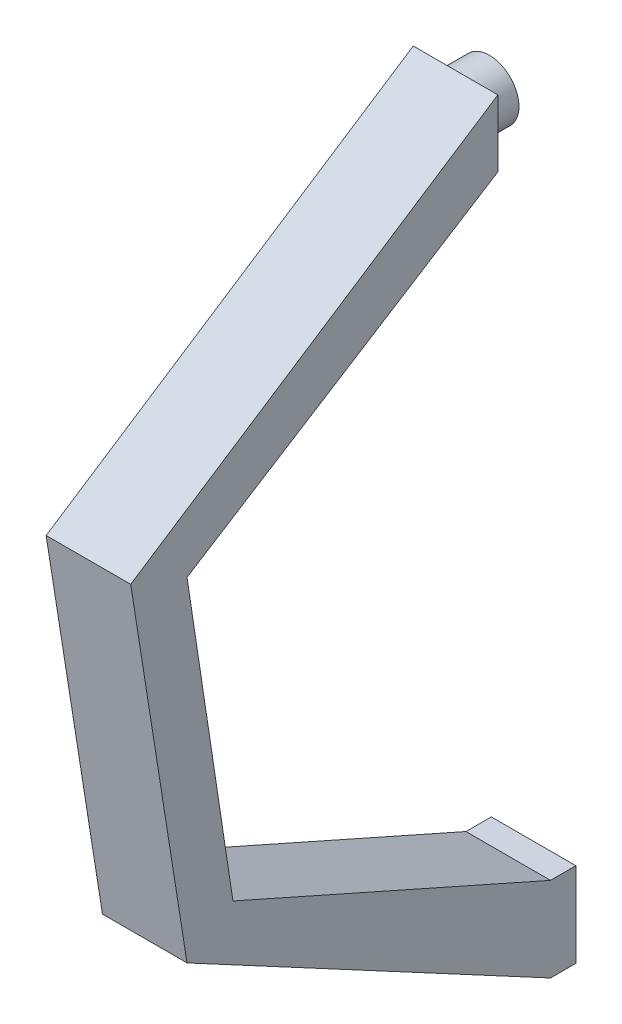
ISO-10303-21;
HEADER;
FILE_DESCRIPTION(('STEP AP214'),'2;1');
FILE_NAME('part.step','',(''),(''),'','','');
FILE_SCHEMA(('AUTOMOTIVE_DESIGN { 1 0 10303 214 1 1 1 1 }'));
ENDSEC;
DATA;
#1=APPLICATION_CONTEXT('core data for automotive mechanical design processes');
#2=APPLICATION_PROTOCOL_DEFINITION('international standard','automotive_design',2000,#1);
#3=PRODUCT_CONTEXT('',#1,'mechanical');
#4=PRODUCT('Part','Part','',(#3));
#5=PRODUCT_RELATED_PRODUCT_CATEGORY('part','',(#4));
#6=PRODUCT_DEFINITION_FORMATION('','',#4);
#7=PRODUCT_DEFINITION_CONTEXT('part definition',#1,'design');
#8=PRODUCT_DEFINITION('design','',#6,#7);
#9=PRODUCT_DEFINITION_SHAPE('','',#8);
#10=(LENGTH_UNIT() NAMED_UNIT(*) SI_UNIT(.MILLI.,.METRE.));
#11=(NAMED_UNIT(*) PLANE_ANGLE_UNIT() SI_UNIT($,.RADIAN.));
#12=(NAMED_UNIT(*) SI_UNIT($,.STERADIAN.) SOLID_ANGLE_UNIT());
#13=UNCERTAINTY_MEASURE_WITH_UNIT(LENGTH_MEASURE(1.E-05),#10,'distance_accuracy_value','');
#14=(GEOMETRIC_REPRESENTATION_CONTEXT(3) GLOBAL_UNCERTAINTY_ASSIGNED_CONTEXT((#13)) GLOBAL_UNIT_ASSIGNED_CONTEXT((#10,
#11,#12)) REPRESENTATION_CONTEXT('',''));
#15=CARTESIAN_POINT('',(0.,0.,0.));
#16=DIRECTION('',(0.,0.,1.));
#17=DIRECTION('',(1.,0.,0.));
#18=AXIS2_PLACEMENT_3D('',#15,#16,#17);
#19=CARTESIAN_POINT('',(0.,100.,30.));
#20=DIRECTION('',(1.,0.,0.));
#21=DIRECTION('',(0.,1.,0.));
#22=AXIS2_PLACEMENT_3D('',#19,#20,#21);
#23=PLANE('',#22);
#24=DIRECTION('',(0.,-1.,0.));
#25=VECTOR('',#24,1.);
#26=CARTESIAN_POINT('',(0.,100.,0.));
#27=LINE('',#26,#25);
#28=CARTESIAN_POINT('',(0.,100.,0.));
#29=VERTEX_POINT('',#28);
#30=CARTESIAN_POINT('',(0.,0.,0.));
#31=VERTEX_POINT('',#30);
#32=EDGE_CURVE('E154',#29,#31,#27,.T.);
#33=ORIENTED_EDGE('',*,*,#32,.T.);
#34=DIRECTION('',(0.,0.,-1.));
#35=VECTOR('',#34,1.);
#36=CARTESIAN_POINT('',(0.,0.,30.));
#37=LINE('',#36,#35);
#38=CARTESIAN_POINT('',(0.,0.,30.));
#39=VERTEX_POINT('',#38);
#40=EDGE_CURVE('E54',#39,#31,#37,.T.);
#41=ORIENTED_EDGE('',*,*,#40,.F.);
#42=DIRECTION('',(0.,0.472352728137515,0.881409609784831));
#43=VECTOR('',#42,1.);
#44=CARTESIAN_POINT('',(0.,0.,30.));
#45=LINE('',#44,#43);
#46=CARTESIAN_POINT('',(0.,230.355875202712,459.843779826663));
#47=VERTEX_POINT('',#46);
#48=EDGE_CURVE('E148',#39,#47,#45,.T.);
#49=ORIENTED_EDGE('',*,*,#48,.T.);
#50=DIRECTION('',(0.,-0.98772396333575,-0.156209385929012));
#51=VECTOR('',#50,1.);
#52=CARTESIAN_POINT('',(0.,651.42213648852,526.435767621256));
#53=LINE('',#52,#51);
#54=CARTESIAN_POINT('',(0.,651.42213648852,526.435767621256));
#55=VERTEX_POINT('',#54);
#56=EDGE_CURVE('E358',#55,#47,#53,.T.);
#57=ORIENTED_EDGE('',*,*,#56,.F.);
#58=DIRECTION('',(0.,-0.54770302127678,0.836672815671865));
#59=VECTOR('',#58,1.);
#60=CARTESIAN_POINT('',(0.,935.622570944281,92.2903120110954));
#61=LINE('',#60,#59);
#62=CARTESIAN_POINT('',(0.,935.622570944281,92.2903120110954));
#63=VERTEX_POINT('',#62);
#64=EDGE_CURVE('E355',#63,#55,#61,.T.);
#65=ORIENTED_EDGE('',*,*,#64,.F.);
#66=DIRECTION('',(0.,1.,0.));
#67=VECTOR('',#66,1.);
#68=CARTESIAN_POINT('',(0.,856.669682909021,92.2903120110954));
#69=LINE('',#68,#67);
#70=CARTESIAN_POINT('',(0.,856.669682909021,92.2903120110954));
#71=VERTEX_POINT('',#70);
#72=EDGE_CURVE('E352',#71,#63,#69,.T.);
#73=ORIENTED_EDGE('',*,*,#72,.F.);
#74=DIRECTION('',(0.,0.532798568616356,-0.846242096140556));
#75=VECTOR('',#74,1.);
#76=CARTESIAN_POINT('',(0.,625.256045564294,459.843779826663));
#77=LINE('',#76,#75);
#78=CARTESIAN_POINT('',(0.,625.256045564294,459.843779826663));
#79=VERTEX_POINT('',#78);
#80=EDGE_CURVE('E349',#79,#71,#77,.T.);
#81=ORIENTED_EDGE('',*,*,#80,.F.);
#82=DIRECTION('',(0.,0.988730161321214,0.149708610619849));
#83=VECTOR('',#82,1.);
#84=CARTESIAN_POINT('',(0.,266.651744151066,405.545697471072));
#85=LINE('',#84,#83);
#86=CARTESIAN_POINT('',(0.,266.651744151066,405.545697471072));
#87=VERTEX_POINT('',#86);
#88=EDGE_CURVE('E328',#87,#79,#85,.T.);
#89=ORIENTED_EDGE('',*,*,#88,.F.);
#90=DIRECTION('',(0.,0.405615138377561,0.914043959292414));
#91=VECTOR('',#90,1.);
#92=CARTESIAN_POINT('',(0.,100.,30.));
#93=LINE('',#92,#91);
#94=CARTESIAN_POINT('',(0.,100.,30.));
#95=VERTEX_POINT('',#94);
#96=EDGE_CURVE('E152',#95,#87,#93,.T.);
#97=ORIENTED_EDGE('',*,*,#96,.F.);
#98=DIRECTION('',(0.,0.,-1.));
#99=VECTOR('',#98,1.);
#100=CARTESIAN_POINT('',(0.,100.,30.));
#101=LINE('',#100,#99);
#102=EDGE_CURVE('E169',#95,#29,#101,.T.);
#103=ORIENTED_EDGE('',*,*,#102,.T.);
#104=EDGE_LOOP('',(#33,#41,#49,#57,#65,#73,#81,#89,#97,#103));
#105=FACE_BOUND('',#104,.T.);
#106=ADVANCED_FACE('F45',(#105),#23,.F.);
#107=CARTESIAN_POINT('',(0.,0.,30.));
#108=DIRECTION('',(0.,1.,0.));
#109=DIRECTION('',(0.,0.,1.));
#110=AXIS2_PLACEMENT_3D('',#107,#108,#109);
#111=PLANE('',#110);
#112=DIRECTION('',(1.,0.,0.));
#113=VECTOR('',#112,1.);
#114=CARTESIAN_POINT('',(0.,0.,0.));
#115=LINE('',#114,#113);
#116=CARTESIAN_POINT('',(100.,0.,0.));
#117=VERTEX_POINT('',#116);
#118=EDGE_CURVE('E159',#31,#117,#115,.T.);
#119=ORIENTED_EDGE('',*,*,#118,.T.);
#120=DIRECTION('',(0.,0.,-1.));
#121=VECTOR('',#120,1.);
#122=CARTESIAN_POINT('',(100.,0.,30.));
#123=LINE('',#122,#121);
#124=CARTESIAN_POINT('',(100.,0.,30.));
#125=VERTEX_POINT('',#124);
#126=EDGE_CURVE('E181',#125,#117,#123,.T.);
#127=ORIENTED_EDGE('',*,*,#126,.F.);
#128=DIRECTION('',(1.,0.,0.));
#129=VECTOR('',#128,1.);
#130=CARTESIAN_POINT('',(0.,0.,30.));
#131=LINE('',#130,#129);
#132=EDGE_CURVE('E89',#39,#125,#131,.T.);
#133=ORIENTED_EDGE('',*,*,#132,.F.);
#134=ORIENTED_EDGE('',*,*,#40,.T.);
#135=EDGE_LOOP('',(#119,#127,#133,#134));
#136=FACE_BOUND('',#135,.T.);
#137=ADVANCED_FACE('F184',(#136),#111,.F.);
#138=CARTESIAN_POINT('',(100.,0.,30.));
#139=DIRECTION('',(-1.,0.,0.));
#140=DIRECTION('',(0.,0.,1.));
#141=AXIS2_PLACEMENT_3D('',#138,#139,#140);
#142=PLANE('',#141);
#143=DIRECTION('',(0.,1.,0.));
#144=VECTOR('',#143,1.);
#145=CARTESIAN_POINT('',(100.,0.,0.));
#146=LINE('',#145,#144);
#147=CARTESIAN_POINT('',(100.,100.,0.));
#148=VERTEX_POINT('',#147);
#149=EDGE_CURVE('E78',#117,#148,#146,.T.);
#150=ORIENTED_EDGE('',*,*,#149,.T.);
#151=DIRECTION('',(0.,0.,-1.));
#152=VECTOR('',#151,1.);
#153=CARTESIAN_POINT('',(100.,100.,30.));
#154=LINE('',#153,#152);
#155=CARTESIAN_POINT('',(100.,100.,30.));
#156=VERTEX_POINT('',#155);
#157=EDGE_CURVE('E62',#156,#148,#154,.T.);
#158=ORIENTED_EDGE('',*,*,#157,.F.);
#159=DIRECTION('',(0.,0.405615138377561,0.914043959292414));
#160=VECTOR('',#159,1.);
#161=CARTESIAN_POINT('',(100.,100.,30.));
#162=LINE('',#161,#160);
#163=CARTESIAN_POINT('',(100.,266.651744151066,405.545697471072));
#164=VERTEX_POINT('',#163);
#165=EDGE_CURVE('E141',#156,#164,#162,.T.);
#166=ORIENTED_EDGE('',*,*,#165,.T.);
#167=DIRECTION('',(0.,0.988730161321214,0.149708610619849));
#168=VECTOR('',#167,1.);
#169=CARTESIAN_POINT('',(100.,266.651744151066,405.545697471072));
#170=LINE('',#169,#168);
#171=CARTESIAN_POINT('',(100.,625.256045564294,459.843779826663));
#172=VERTEX_POINT('',#171);
#173=EDGE_CURVE('E131',#164,#172,#170,.T.);
#174=ORIENTED_EDGE('',*,*,#173,.T.);
#175=DIRECTION('',(0.,0.532798568616356,-0.846242096140556));
#176=VECTOR('',#175,1.);
#177=CARTESIAN_POINT('',(100.,625.256045564294,459.843779826663));
#178=LINE('',#177,#176);
#179=CARTESIAN_POINT('',(100.,856.669682909021,92.2903120110954));
#180=VERTEX_POINT('',#179);
#181=EDGE_CURVE('E140',#172,#180,#178,.T.);
#182=ORIENTED_EDGE('',*,*,#181,.T.);
#183=DIRECTION('',(0.,1.,0.));
#184=VECTOR('',#183,1.);
#185=CARTESIAN_POINT('',(100.,856.669682909021,92.2903120110954));
#186=LINE('',#185,#184);
#187=CARTESIAN_POINT('',(100.,935.622570944281,92.2903120110954));
#188=VERTEX_POINT('',#187);
#189=EDGE_CURVE('E333',#180,#188,#186,.T.);
#190=ORIENTED_EDGE('',*,*,#189,.T.);
#191=DIRECTION('',(0.,-0.54770302127678,0.836672815671865));
#192=VECTOR('',#191,1.);
#193=CARTESIAN_POINT('',(100.,935.622570944281,92.2903120110954));
#194=LINE('',#193,#192);
#195=CARTESIAN_POINT('',(100.,651.42213648852,526.435767621256));
#196=VERTEX_POINT('',#195);
#197=EDGE_CURVE('E336',#188,#196,#194,.T.);
#198=ORIENTED_EDGE('',*,*,#197,.T.);
#199=DIRECTION('',(0.,-0.98772396333575,-0.156209385929012));
#200=VECTOR('',#199,1.);
#201=CARTESIAN_POINT('',(100.,651.42213648852,526.435767621256));
#202=LINE('',#201,#200);
#203=CARTESIAN_POINT('',(100.,230.355875202712,459.843779826663));
#204=VERTEX_POINT('',#203);
#205=EDGE_CURVE('E339',#196,#204,#202,.T.);
#206=ORIENTED_EDGE('',*,*,#205,.T.);
#207=DIRECTION('',(0.,0.472352728137515,0.881409609784831));
#208=VECTOR('',#207,1.);
#209=CARTESIAN_POINT('',(100.,0.,30.));
#210=LINE('',#209,#208);
#211=EDGE_CURVE('E342',#125,#204,#210,.T.);
#212=ORIENTED_EDGE('',*,*,#211,.F.);
#213=ORIENTED_EDGE('',*,*,#126,.T.);
#214=EDGE_LOOP('',(#150,#158,#166,#174,#182,#190,#198,#206,#212,#213));
#215=FACE_BOUND('',#214,.T.);
#216=ADVANCED_FACE('F144',(#215),#142,.F.);
#217=CARTESIAN_POINT('',(100.,100.,30.));
#218=DIRECTION('',(0.,-1.,0.));
#219=DIRECTION('',(1.,0.,0.));
#220=AXIS2_PLACEMENT_3D('',#217,#218,#219);
#221=PLANE('',#220);
#222=DIRECTION('',(-1.,0.,0.));
#223=VECTOR('',#222,1.);
#224=CARTESIAN_POINT('',(100.,100.,0.));
#225=LINE('',#224,#223);
#226=EDGE_CURVE('E83',#148,#29,#225,.T.);
#227=ORIENTED_EDGE('',*,*,#226,.T.);
#228=ORIENTED_EDGE('',*,*,#102,.F.);
#229=DIRECTION('',(-1.,0.,0.));
#230=VECTOR('',#229,1.);
#231=CARTESIAN_POINT('',(100.,100.,30.));
#232=LINE('',#231,#230);
#233=EDGE_CURVE('E167',#156,#95,#232,.T.);
#234=ORIENTED_EDGE('',*,*,#233,.F.);
#235=ORIENTED_EDGE('',*,*,#157,.T.);
#236=EDGE_LOOP('',(#227,#228,#234,#235));
#237=FACE_BOUND('',#236,.T.);
#238=ADVANCED_FACE('F192',(#237),#221,.F.);
#239=CARTESIAN_POINT('',(0.,0.,0.));
#240=DIRECTION('',(0.,0.,1.));
#241=DIRECTION('',(1.,0.,0.));
#242=AXIS2_PLACEMENT_3D('',#239,#240,#241);
#243=PLANE('',#242);
#244=ORIENTED_EDGE('',*,*,#32,.F.);
#245=ORIENTED_EDGE('',*,*,#226,.F.);
#246=ORIENTED_EDGE('',*,*,#149,.F.);
#247=ORIENTED_EDGE('',*,*,#118,.F.);
#248=EDGE_LOOP('',(#244,#245,#246,#247));
#249=FACE_BOUND('',#248,.T.);
#250=ADVANCED_FACE('F190',(#249),#243,.F.);
#251=CARTESIAN_POINT('',(100.,100.,30.));
#252=DIRECTION('',(0.,-0.914043959292414,0.405615138377561));
#253=DIRECTION('',(0.,-0.405615138377561,-0.914043959292414));
#254=AXIS2_PLACEMENT_3D('',#251,#252,#253);
#255=PLANE('',#254);
#256=ORIENTED_EDGE('',*,*,#96,.T.);
#257=DIRECTION('',(-1.,0.,0.));
#258=VECTOR('',#257,1.);
#259=CARTESIAN_POINT('',(100.,266.651744151066,405.545697471072));
#260=LINE('',#259,#258);
#261=EDGE_CURVE('E134',#164,#87,#260,.T.);
#262=ORIENTED_EDGE('',*,*,#261,.F.);
#263=ORIENTED_EDGE('',*,*,#165,.F.);
#264=ORIENTED_EDGE('',*,*,#233,.T.);
#265=EDGE_LOOP('',(#256,#262,#263,#264));
#266=FACE_BOUND('',#265,.T.);
#267=ADVANCED_FACE('F150',(#266),#255,.F.);
#268=CARTESIAN_POINT('',(100.,266.651744151066,405.545697471072));
#269=DIRECTION('',(0.,-0.149708610619849,0.988730161321214));
#270=DIRECTION('',(0.,-0.988730161321214,-0.149708610619849));
#271=AXIS2_PLACEMENT_3D('',#268,#269,#270);
#272=PLANE('',#271);
#273=ORIENTED_EDGE('',*,*,#88,.T.);
#274=DIRECTION('',(-1.,0.,0.));
#275=VECTOR('',#274,1.);
#276=CARTESIAN_POINT('',(100.,625.256045564294,459.843779826663));
#277=LINE('',#276,#275);
#278=EDGE_CURVE('E137',#172,#79,#277,.T.);
#279=ORIENTED_EDGE('',*,*,#278,.F.);
#280=ORIENTED_EDGE('',*,*,#173,.F.);
#281=ORIENTED_EDGE('',*,*,#261,.T.);
#282=EDGE_LOOP('',(#273,#279,#280,#281));
#283=FACE_BOUND('',#282,.T.);
#284=ADVANCED_FACE('F132',(#283),#272,.F.);
#285=CARTESIAN_POINT('',(100.,625.256045564294,459.843779826663));
#286=DIRECTION('',(0.,0.846242096140556,0.532798568616356));
#287=DIRECTION('',(0.,-0.532798568616356,0.846242096140556));
#288=AXIS2_PLACEMENT_3D('',#285,#286,#287);
#289=PLANE('',#288);
#290=ORIENTED_EDGE('',*,*,#80,.T.);
#291=DIRECTION('',(-1.,0.,0.));
#292=VECTOR('',#291,1.);
#293=CARTESIAN_POINT('',(100.,856.669682909021,92.2903120110954));
#294=LINE('',#293,#292);
#295=EDGE_CURVE('E161',#180,#71,#294,.T.);
#296=ORIENTED_EDGE('',*,*,#295,.F.);
#297=ORIENTED_EDGE('',*,*,#181,.F.);
#298=ORIENTED_EDGE('',*,*,#278,.T.);
#299=EDGE_LOOP('',(#290,#296,#297,#298));
#300=FACE_BOUND('',#299,.T.);
#301=ADVANCED_FACE('F227',(#300),#289,.F.);
#302=CARTESIAN_POINT('',(100.,856.669682909021,92.2903120110954));
#303=DIRECTION('',(0.,0.,1.));
#304=DIRECTION('',(1.,0.,0.));
#305=AXIS2_PLACEMENT_3D('',#302,#303,#304);
#306=PLANE('',#305);
#307=CARTESIAN_POINT('',(50.,896.146126926651,92.2903120110954));
#308=DIRECTION('',(0.,0.,1.));
#309=DIRECTION('',(1.,0.,0.));
#310=AXIS2_PLACEMENT_3D('',#307,#308,#309);
#311=CIRCLE('',#310,35.);
#312=CARTESIAN_POINT('',(85.,896.146126926651,92.2903120110954));
#313=VERTEX_POINT('',#312);
#314=EDGE_CURVE('E11',#313,#313,#311,.F.);
#315=ORIENTED_EDGE('',*,*,#314,.F.);
#316=EDGE_LOOP('',(#315));
#317=FACE_BOUND('',#316,.T.);
#318=ORIENTED_EDGE('',*,*,#72,.T.);
#319=DIRECTION('',(-1.,0.,0.));
#320=VECTOR('',#319,1.);
#321=CARTESIAN_POINT('',(100.,935.622570944281,92.2903120110954));
#322=LINE('',#321,#320);
#323=EDGE_CURVE('E370',#188,#63,#322,.T.);
#324=ORIENTED_EDGE('',*,*,#323,.F.);
#325=ORIENTED_EDGE('',*,*,#189,.F.);
#326=ORIENTED_EDGE('',*,*,#295,.T.);
#327=EDGE_LOOP('',(#318,#324,#325,#326));
#328=FACE_BOUND('',#327,.T.);
#329=ADVANCED_FACE('F235',(#317,#328),#306,.F.);
#330=CARTESIAN_POINT('',(100.,935.622570944281,92.2903120110954));
#331=DIRECTION('',(0.,-0.836672815671865,-0.54770302127678));
#332=DIRECTION('',(0.,0.54770302127678,-0.836672815671865));
#333=AXIS2_PLACEMENT_3D('',#330,#331,#332);
#334=PLANE('',#333);
#335=ORIENTED_EDGE('',*,*,#64,.T.);
#336=DIRECTION('',(-1.,0.,0.));
#337=VECTOR('',#336,1.);
#338=CARTESIAN_POINT('',(100.,651.42213648852,526.435767621256));
#339=LINE('',#338,#337);
#340=EDGE_CURVE('E366',#196,#55,#339,.T.);
#341=ORIENTED_EDGE('',*,*,#340,.F.);
#342=ORIENTED_EDGE('',*,*,#197,.F.);
#343=ORIENTED_EDGE('',*,*,#323,.T.);
#344=EDGE_LOOP('',(#335,#341,#342,#343));
#345=FACE_BOUND('',#344,.T.);
#346=ADVANCED_FACE('F242',(#345),#334,.F.);
#347=CARTESIAN_POINT('',(100.,651.42213648852,526.435767621256));
#348=DIRECTION('',(0.,0.156209385929012,-0.987723963335749));
#349=DIRECTION('',(0.,0.98772396333575,0.156209385929012));
#350=AXIS2_PLACEMENT_3D('',#347,#348,#349);
#351=PLANE('',#350);
#352=ORIENTED_EDGE('',*,*,#56,.T.);
#353=DIRECTION('',(-1.,0.,0.));
#354=VECTOR('',#353,1.);
#355=CARTESIAN_POINT('',(100.,230.355875202712,459.843779826663));
#356=LINE('',#355,#354);
#357=EDGE_CURVE('E345',#204,#47,#356,.T.);
#358=ORIENTED_EDGE('',*,*,#357,.F.);
#359=ORIENTED_EDGE('',*,*,#205,.F.);
#360=ORIENTED_EDGE('',*,*,#340,.T.);
#361=EDGE_LOOP('',(#352,#358,#359,#360));
#362=FACE_BOUND('',#361,.T.);
#363=ADVANCED_FACE('F246',(#362),#351,.F.);
#364=CARTESIAN_POINT('',(100.,0.,30.));
#365=DIRECTION('',(0.,-0.881409609784831,0.472352728137515));
#366=DIRECTION('',(0.,-0.472352728137515,-0.88140960978483));
#367=AXIS2_PLACEMENT_3D('',#364,#365,#366);
#368=PLANE('',#367);
#369=ORIENTED_EDGE('',*,*,#48,.F.);
#370=ORIENTED_EDGE('',*,*,#132,.T.);
#371=ORIENTED_EDGE('',*,*,#211,.T.);
#372=ORIENTED_EDGE('',*,*,#357,.T.);
#373=EDGE_LOOP('',(#369,#370,#371,#372));
#374=FACE_BOUND('',#373,.T.);
#375=ADVANCED_FACE('F255',(#374),#368,.T.);
#376=CARTESIAN_POINT('',(50.,896.146126926651,52.2903120110954));
#377=DIRECTION('',(0.,0.,1.));
#378=DIRECTION('',(1.,0.,0.));
#379=AXIS2_PLACEMENT_3D('',#376,#377,#378);
#380=CYLINDRICAL_SURFACE('',#379,35.);
#381=CARTESIAN_POINT('',(50.,896.146126926651,52.2903120110954));
#382=DIRECTION('',(0.,0.,-1.));
#383=DIRECTION('',(-1.,0.,0.));
#384=AXIS2_PLACEMENT_3D('',#381,#382,#383);
#385=CIRCLE('',#384,35.);
#386=CARTESIAN_POINT('',(15.,896.146126926651,52.2903120110954));
#387=VERTEX_POINT('',#386);
#388=EDGE_CURVE('E324',#387,#387,#385,.T.);
#389=ORIENTED_EDGE('',*,*,#388,.F.);
#390=EDGE_LOOP('',(#389));
#391=FACE_BOUND('',#390,.T.);
#392=ORIENTED_EDGE('',*,*,#314,.T.);
#393=EDGE_LOOP('',(#392));
#394=FACE_BOUND('',#393,.T.);
#395=ADVANCED_FACE('F264',(#391,#394),#380,.T.);
#396=CARTESIAN_POINT('',(50.,896.146126926651,52.2903120110954));
#397=DIRECTION('',(0.,0.,-1.));
#398=DIRECTION('',(-1.,0.,0.));
#399=AXIS2_PLACEMENT_3D('',#396,#397,#398);
#400=PLANE('',#399);
#401=ORIENTED_EDGE('',*,*,#388,.T.);
#402=EDGE_LOOP('',(#401));
#403=FACE_BOUND('',#402,.T.);
#404=ADVANCED_FACE('F280',(#403),#400,.T.);
#405=CLOSED_SHELL('',(#106,#137,#216,#238,#250,#267,#284,#301,#329,#346,#363,#375,#395,#404));
#406=MANIFOLD_SOLID_BREP('B2',#405);
#407=ADVANCED_BREP_SHAPE_REPRESENTATION('',(#18,#406),#14);
#408=SHAPE_DEFINITION_REPRESENTATION(#9,#407);
ENDSEC;
END-ISO-10303-21;
